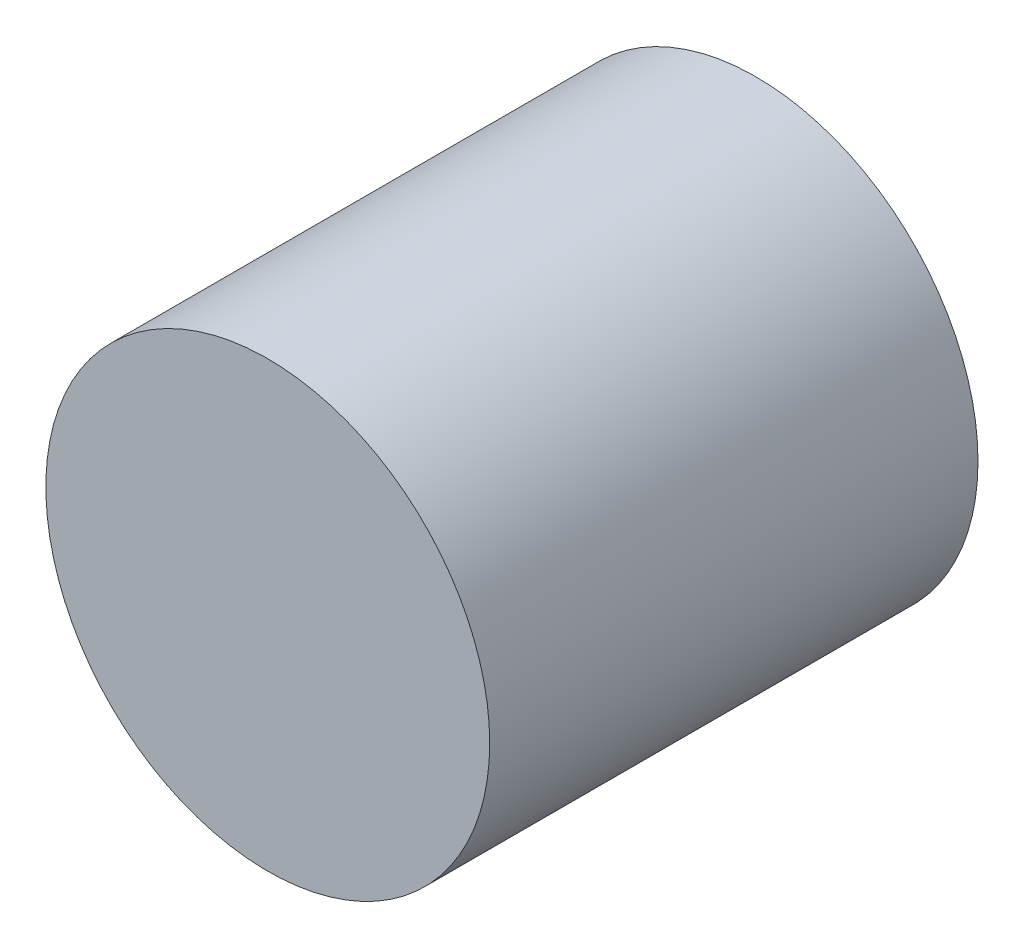
ISO-10303-21;
HEADER;
FILE_DESCRIPTION(('STEP AP214'),'2;1');
FILE_NAME('part.step','',(''),(''),'','','');
FILE_SCHEMA(('AUTOMOTIVE_DESIGN { 1 0 10303 214 1 1 1 1 }'));
ENDSEC;
DATA;
#1=APPLICATION_CONTEXT('core data for automotive mechanical design processes');
#2=APPLICATION_PROTOCOL_DEFINITION('international standard','automotive_design',2000,#1);
#3=PRODUCT_CONTEXT('',#1,'mechanical');
#4=PRODUCT('Part','Part','',(#3));
#5=PRODUCT_RELATED_PRODUCT_CATEGORY('part','',(#4));
#6=PRODUCT_DEFINITION_FORMATION('','',#4);
#7=PRODUCT_DEFINITION_CONTEXT('part definition',#1,'design');
#8=PRODUCT_DEFINITION('design','',#6,#7);
#9=PRODUCT_DEFINITION_SHAPE('','',#8);
#10=(LENGTH_UNIT() NAMED_UNIT(*) SI_UNIT(.MILLI.,.METRE.));
#11=(NAMED_UNIT(*) PLANE_ANGLE_UNIT() SI_UNIT($,.RADIAN.));
#12=(NAMED_UNIT(*) SI_UNIT($,.STERADIAN.) SOLID_ANGLE_UNIT());
#13=UNCERTAINTY_MEASURE_WITH_UNIT(LENGTH_MEASURE(1.E-05),#10,'distance_accuracy_value','');
#14=(GEOMETRIC_REPRESENTATION_CONTEXT(3) GLOBAL_UNCERTAINTY_ASSIGNED_CONTEXT((#13)) GLOBAL_UNIT_ASSIGNED_CONTEXT((#10,
#11,#12)) REPRESENTATION_CONTEXT('',''));
#15=CARTESIAN_POINT('',(0.,0.,0.));
#16=DIRECTION('',(0.,0.,1.));
#17=DIRECTION('',(1.,0.,0.));
#18=AXIS2_PLACEMENT_3D('',#15,#16,#17);
#19=CARTESIAN_POINT('',(0.,0.,11.));
#20=DIRECTION('',(0.,0.,-1.));
#21=DIRECTION('',(-1.,0.,0.));
#22=AXIS2_PLACEMENT_3D('',#19,#20,#21);
#23=CYLINDRICAL_SURFACE('',#22,5.);
#24=CARTESIAN_POINT('',(0.,0.,11.));
#25=DIRECTION('',(0.,0.,1.));
#26=DIRECTION('',(1.,0.,0.));
#27=AXIS2_PLACEMENT_3D('',#24,#25,#26);
#28=CIRCLE('',#27,5.);
#29=CARTESIAN_POINT('',(5.,0.,11.));
#30=VERTEX_POINT('',#29);
#31=EDGE_CURVE('E10',#30,#30,#28,.T.);
#32=ORIENTED_EDGE('',*,*,#31,.F.);
#33=EDGE_LOOP('',(#32));
#34=FACE_BOUND('',#33,.T.);
#35=CARTESIAN_POINT('',(0.,0.,0.));
#36=DIRECTION('',(0.,0.,1.));
#37=DIRECTION('',(1.,0.,0.));
#38=AXIS2_PLACEMENT_3D('',#35,#36,#37);
#39=CIRCLE('',#38,5.);
#40=CARTESIAN_POINT('',(5.,0.,0.));
#41=VERTEX_POINT('',#40);
#42=EDGE_CURVE('E34',#41,#41,#39,.T.);
#43=ORIENTED_EDGE('',*,*,#42,.T.);
#44=EDGE_LOOP('',(#43));
#45=FACE_BOUND('',#44,.T.);
#46=ADVANCED_FACE('F31',(#34,#45),#23,.T.);
#47=CARTESIAN_POINT('',(0.,0.,11.));
#48=DIRECTION('',(0.,0.,1.));
#49=DIRECTION('',(1.,0.,0.));
#50=AXIS2_PLACEMENT_3D('',#47,#48,#49);
#51=PLANE('',#50);
#52=ORIENTED_EDGE('',*,*,#31,.T.);
#53=EDGE_LOOP('',(#52));
#54=FACE_BOUND('',#53,.T.);
#55=ADVANCED_FACE('F46',(#54),#51,.T.);
#56=CARTESIAN_POINT('',(0.,0.,0.));
#57=DIRECTION('',(0.,0.,1.));
#58=DIRECTION('',(1.,0.,0.));
#59=AXIS2_PLACEMENT_3D('',#56,#57,#58);
#60=PLANE('',#59);
#61=ORIENTED_EDGE('',*,*,#42,.F.);
#62=EDGE_LOOP('',(#61));
#63=FACE_BOUND('',#62,.T.);
#64=ADVANCED_FACE('F44',(#63),#60,.F.);
#65=CLOSED_SHELL('',(#46,#55,#64));
#66=MANIFOLD_SOLID_BREP('B2',#65);
#67=ADVANCED_BREP_SHAPE_REPRESENTATION('',(#18,#66),#14);
#68=SHAPE_DEFINITION_REPRESENTATION(#9,#67);
ENDSEC;
END-ISO-10303-21;
